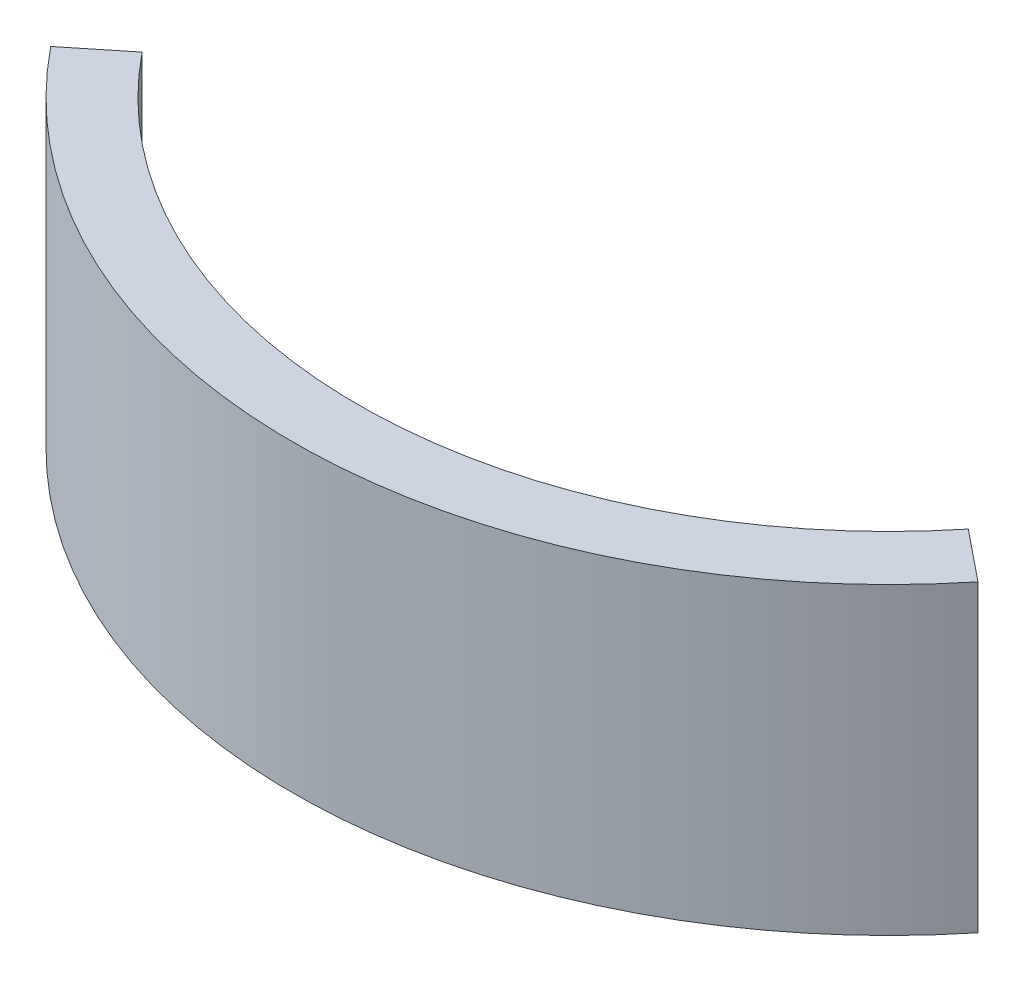
ISO-10303-21;
HEADER;
FILE_DESCRIPTION(('STEP AP214'),'2;1');
FILE_NAME('part.step','',(''),(''),'','','');
FILE_SCHEMA(('AUTOMOTIVE_DESIGN { 1 0 10303 214 1 1 1 1 }'));
ENDSEC;
DATA;
#1=APPLICATION_CONTEXT('core data for automotive mechanical design processes');
#2=APPLICATION_PROTOCOL_DEFINITION('international standard','automotive_design',2000,#1);
#3=PRODUCT_CONTEXT('',#1,'mechanical');
#4=PRODUCT('Part','Part','',(#3));
#5=PRODUCT_RELATED_PRODUCT_CATEGORY('part','',(#4));
#6=PRODUCT_DEFINITION_FORMATION('','',#4);
#7=PRODUCT_DEFINITION_CONTEXT('part definition',#1,'design');
#8=PRODUCT_DEFINITION('design','',#6,#7);
#9=PRODUCT_DEFINITION_SHAPE('','',#8);
#10=(LENGTH_UNIT() NAMED_UNIT(*) SI_UNIT(.MILLI.,.METRE.));
#11=(NAMED_UNIT(*) PLANE_ANGLE_UNIT() SI_UNIT($,.RADIAN.));
#12=(NAMED_UNIT(*) SI_UNIT($,.STERADIAN.) SOLID_ANGLE_UNIT());
#13=UNCERTAINTY_MEASURE_WITH_UNIT(LENGTH_MEASURE(1.E-05),#10,'distance_accuracy_value','');
#14=(GEOMETRIC_REPRESENTATION_CONTEXT(3) GLOBAL_UNCERTAINTY_ASSIGNED_CONTEXT((#13)) GLOBAL_UNIT_ASSIGNED_CONTEXT((#10,
#11,#12)) REPRESENTATION_CONTEXT('',''));
#15=CARTESIAN_POINT('',(0.,0.,0.));
#16=DIRECTION('',(0.,0.,1.));
#17=DIRECTION('',(1.,0.,0.));
#18=AXIS2_PLACEMENT_3D('',#15,#16,#17);
#19=CARTESIAN_POINT('',(0.,6.08,-11.92));
#20=DIRECTION('',(0.,-1.,0.));
#21=DIRECTION('',(0.,0.,-1.));
#22=AXIS2_PLACEMENT_3D('',#19,#20,#21);
#23=CYLINDRICAL_SURFACE('',#22,11.92);
#24=CARTESIAN_POINT('',(0.,0.,-11.92));
#25=DIRECTION('',(0.,1.,0.));
#26=DIRECTION('',(0.,0.,1.));
#27=AXIS2_PLACEMENT_3D('',#24,#25,#26);
#28=CIRCLE('',#27,11.92);
#29=CARTESIAN_POINT('',(-9.27404489584876,0.,-4.43144264428845));
#30=VERTEX_POINT('',#29);
#31=CARTESIAN_POINT('',(9.27404489584876,0.,-4.43144264428845));
#32=VERTEX_POINT('',#31);
#33=EDGE_CURVE('E98',#30,#32,#28,.T.);
#34=ORIENTED_EDGE('',*,*,#33,.T.);
#35=DIRECTION('',(0.,-1.,0.));
#36=VECTOR('',#35,1.);
#37=CARTESIAN_POINT('',(9.27404489584876,6.08,-4.43144264428845));
#38=LINE('',#37,#36);
#39=CARTESIAN_POINT('',(9.27404489584876,6.08,-4.43144264428845));
#40=VERTEX_POINT('',#39);
#41=EDGE_CURVE('E11',#40,#32,#38,.T.);
#42=ORIENTED_EDGE('',*,*,#41,.F.);
#43=CARTESIAN_POINT('',(0.,6.08,-11.92));
#44=DIRECTION('',(0.,1.,0.));
#45=DIRECTION('',(0.,0.,1.));
#46=AXIS2_PLACEMENT_3D('',#43,#44,#45);
#47=CIRCLE('',#46,11.92);
#48=CARTESIAN_POINT('',(-9.27404489584876,6.08,-4.43144264428845));
#49=VERTEX_POINT('',#48);
#50=EDGE_CURVE('E86',#49,#40,#47,.T.);
#51=ORIENTED_EDGE('',*,*,#50,.F.);
#52=DIRECTION('',(0.,-1.,0.));
#53=VECTOR('',#52,1.);
#54=CARTESIAN_POINT('',(-9.27404489584876,6.08,-4.43144264428845));
#55=LINE('',#54,#53);
#56=EDGE_CURVE('E94',#49,#30,#55,.T.);
#57=ORIENTED_EDGE('',*,*,#56,.T.);
#58=EDGE_LOOP('',(#34,#42,#51,#57));
#59=FACE_BOUND('',#58,.T.);
#60=ADVANCED_FACE('F35',(#59),#23,.T.);
#61=CARTESIAN_POINT('',(9.27404489584876,6.08,-4.43144264428845));
#62=DIRECTION('',(-0.62823467749258,0.,0.778023900658452));
#63=DIRECTION('',(0.778023900658453,0.,0.62823467749258));
#64=AXIS2_PLACEMENT_3D('',#61,#62,#63);
#65=PLANE('',#64);
#66=DIRECTION('',(-0.778023900658452,0.,-0.62823467749258));
#67=VECTOR('',#66,1.);
#68=CARTESIAN_POINT('',(9.27404489584876,0.,-4.43144264428845));
#69=LINE('',#68,#67);
#70=CARTESIAN_POINT('',(8.26261382499277,0.,-5.2481477250288));
#71=VERTEX_POINT('',#70);
#72=EDGE_CURVE('E90',#32,#71,#69,.T.);
#73=ORIENTED_EDGE('',*,*,#72,.T.);
#74=DIRECTION('',(0.,-1.,0.));
#75=VECTOR('',#74,1.);
#76=CARTESIAN_POINT('',(8.26261382499277,6.08,-5.2481477250288));
#77=LINE('',#76,#75);
#78=CARTESIAN_POINT('',(8.26261382499277,6.08,-5.2481477250288));
#79=VERTEX_POINT('',#78);
#80=EDGE_CURVE('E43',#79,#71,#77,.T.);
#81=ORIENTED_EDGE('',*,*,#80,.F.);
#82=DIRECTION('',(-0.778023900658452,0.,-0.62823467749258));
#83=VECTOR('',#82,1.);
#84=CARTESIAN_POINT('',(9.27404489584876,6.08,-4.43144264428845));
#85=LINE('',#84,#83);
#86=EDGE_CURVE('E81',#40,#79,#85,.T.);
#87=ORIENTED_EDGE('',*,*,#86,.F.);
#88=ORIENTED_EDGE('',*,*,#41,.T.);
#89=EDGE_LOOP('',(#73,#81,#87,#88));
#90=FACE_BOUND('',#89,.T.);
#91=ADVANCED_FACE('F89',(#90),#65,.F.);
#92=CARTESIAN_POINT('',(0.,6.08,-11.92));
#93=DIRECTION('',(0.,-1.,0.));
#94=DIRECTION('',(0.,0.,-1.));
#95=AXIS2_PLACEMENT_3D('',#92,#93,#94);
#96=CYLINDRICAL_SURFACE('',#95,10.62);
#97=CARTESIAN_POINT('',(0.,0.,-11.92));
#98=DIRECTION('',(0.,-1.,0.));
#99=DIRECTION('',(0.,0.,1.));
#100=AXIS2_PLACEMENT_3D('',#97,#98,#99);
#101=CIRCLE('',#100,10.62);
#102=CARTESIAN_POINT('',(-8.26261382499277,0.,-5.2481477250288));
#103=VERTEX_POINT('',#102);
#104=EDGE_CURVE('E68',#71,#103,#101,.T.);
#105=ORIENTED_EDGE('',*,*,#104,.T.);
#106=DIRECTION('',(0.,-1.,0.));
#107=VECTOR('',#106,1.);
#108=CARTESIAN_POINT('',(-8.26261382499277,6.08,-5.2481477250288));
#109=LINE('',#108,#107);
#110=CARTESIAN_POINT('',(-8.26261382499277,6.08,-5.2481477250288));
#111=VERTEX_POINT('',#110);
#112=EDGE_CURVE('E91',#111,#103,#109,.T.);
#113=ORIENTED_EDGE('',*,*,#112,.F.);
#114=CARTESIAN_POINT('',(0.,6.08,-11.92));
#115=DIRECTION('',(0.,-1.,0.));
#116=DIRECTION('',(0.,0.,1.));
#117=AXIS2_PLACEMENT_3D('',#114,#115,#116);
#118=CIRCLE('',#117,10.62);
#119=EDGE_CURVE('E84',#79,#111,#118,.T.);
#120=ORIENTED_EDGE('',*,*,#119,.F.);
#121=ORIENTED_EDGE('',*,*,#80,.T.);
#122=EDGE_LOOP('',(#105,#113,#120,#121));
#123=FACE_BOUND('',#122,.T.);
#124=ADVANCED_FACE('F92',(#123),#96,.F.);
#125=CARTESIAN_POINT('',(-8.26261382499277,6.08,-5.2481477250288));
#126=DIRECTION('',(0.628234677492581,0.,0.778023900658452));
#127=DIRECTION('',(0.778023900658452,0.,-0.628234677492581));
#128=AXIS2_PLACEMENT_3D('',#125,#126,#127);
#129=PLANE('',#128);
#130=DIRECTION('',(-0.778023900658452,0.,0.628234677492581));
#131=VECTOR('',#130,1.);
#132=CARTESIAN_POINT('',(-8.26261382499277,0.,-5.2481477250288));
#133=LINE('',#132,#131);
#134=EDGE_CURVE('E74',#103,#30,#133,.T.);
#135=ORIENTED_EDGE('',*,*,#134,.T.);
#136=ORIENTED_EDGE('',*,*,#56,.F.);
#137=DIRECTION('',(-0.778023900658452,0.,0.628234677492581));
#138=VECTOR('',#137,1.);
#139=CARTESIAN_POINT('',(-8.26261382499277,6.08,-5.2481477250288));
#140=LINE('',#139,#138);
#141=EDGE_CURVE('E51',#111,#49,#140,.T.);
#142=ORIENTED_EDGE('',*,*,#141,.F.);
#143=ORIENTED_EDGE('',*,*,#112,.T.);
#144=EDGE_LOOP('',(#135,#136,#142,#143));
#145=FACE_BOUND('',#144,.T.);
#146=ADVANCED_FACE('F105',(#145),#129,.F.);
#147=CARTESIAN_POINT('',(0.,6.08,-11.92));
#148=DIRECTION('',(0.,1.,0.));
#149=DIRECTION('',(0.,0.,1.));
#150=AXIS2_PLACEMENT_3D('',#147,#148,#149);
#151=PLANE('',#150);
#152=ORIENTED_EDGE('',*,*,#50,.T.);
#153=ORIENTED_EDGE('',*,*,#86,.T.);
#154=ORIENTED_EDGE('',*,*,#119,.T.);
#155=ORIENTED_EDGE('',*,*,#141,.T.);
#156=EDGE_LOOP('',(#152,#153,#154,#155));
#157=FACE_BOUND('',#156,.T.);
#158=ADVANCED_FACE('F82',(#157),#151,.T.);
#159=CARTESIAN_POINT('',(0.,0.,-11.92));
#160=DIRECTION('',(0.,1.,0.));
#161=DIRECTION('',(0.,0.,1.));
#162=AXIS2_PLACEMENT_3D('',#159,#160,#161);
#163=PLANE('',#162);
#164=ORIENTED_EDGE('',*,*,#33,.F.);
#165=ORIENTED_EDGE('',*,*,#134,.F.);
#166=ORIENTED_EDGE('',*,*,#104,.F.);
#167=ORIENTED_EDGE('',*,*,#72,.F.);
#168=EDGE_LOOP('',(#164,#165,#166,#167));
#169=FACE_BOUND('',#168,.T.);
#170=ADVANCED_FACE('F108',(#169),#163,.F.);
#171=CLOSED_SHELL('',(#60,#91,#124,#146,#158,#170));
#172=MANIFOLD_SOLID_BREP('B2',#171);
#173=ADVANCED_BREP_SHAPE_REPRESENTATION('',(#18,#172),#14);
#174=SHAPE_DEFINITION_REPRESENTATION(#9,#173);
ENDSEC;
END-ISO-10303-21;
